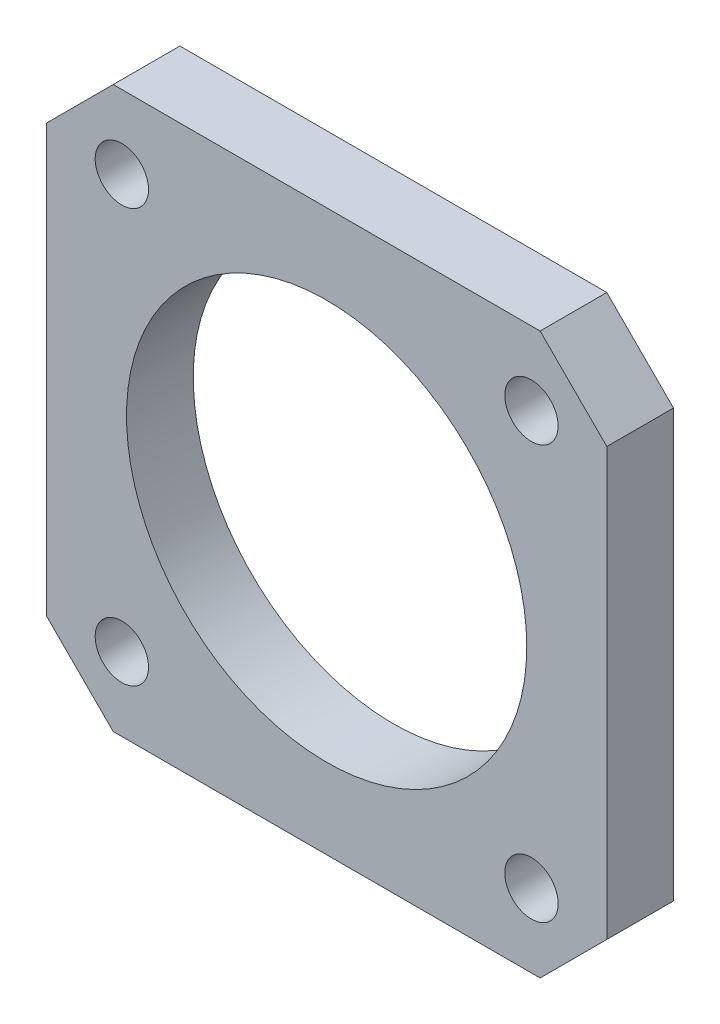
ISO-10303-21;
HEADER;
FILE_DESCRIPTION(('STEP AP214'),'2;1');
FILE_NAME('part.step','',(''),(''),'','','');
FILE_SCHEMA(('AUTOMOTIVE_DESIGN { 1 0 10303 214 1 1 1 1 }'));
ENDSEC;
DATA;
#1=APPLICATION_CONTEXT('core data for automotive mechanical design processes');
#2=APPLICATION_PROTOCOL_DEFINITION('international standard','automotive_design',2000,#1);
#3=PRODUCT_CONTEXT('',#1,'mechanical');
#4=PRODUCT('Part','Part','',(#3));
#5=PRODUCT_RELATED_PRODUCT_CATEGORY('part','',(#4));
#6=PRODUCT_DEFINITION_FORMATION('','',#4);
#7=PRODUCT_DEFINITION_CONTEXT('part definition',#1,'design');
#8=PRODUCT_DEFINITION('design','',#6,#7);
#9=PRODUCT_DEFINITION_SHAPE('','',#8);
#10=(LENGTH_UNIT() NAMED_UNIT(*) SI_UNIT(.MILLI.,.METRE.));
#11=(NAMED_UNIT(*) PLANE_ANGLE_UNIT() SI_UNIT($,.RADIAN.));
#12=(NAMED_UNIT(*) SI_UNIT($,.STERADIAN.) SOLID_ANGLE_UNIT());
#13=UNCERTAINTY_MEASURE_WITH_UNIT(LENGTH_MEASURE(1.E-05),#10,'distance_accuracy_value','');
#14=(GEOMETRIC_REPRESENTATION_CONTEXT(3) GLOBAL_UNCERTAINTY_ASSIGNED_CONTEXT((#13)) GLOBAL_UNIT_ASSIGNED_CONTEXT((#10,
#11,#12)) REPRESENTATION_CONTEXT('',''));
#15=CARTESIAN_POINT('',(0.,0.,0.));
#16=DIRECTION('',(0.,0.,1.));
#17=DIRECTION('',(1.,0.,0.));
#18=AXIS2_PLACEMENT_3D('',#15,#16,#17);
#19=CARTESIAN_POINT('',(0.,0.,5.));
#20=DIRECTION('',(1.,0.,0.));
#21=DIRECTION('',(0.,0.,-1.));
#22=AXIS2_PLACEMENT_3D('',#19,#20,#21);
#23=PLANE('',#22);
#24=DIRECTION('',(0.,-1.,0.));
#25=VECTOR('',#24,1.);
#26=CARTESIAN_POINT('',(0.,0.,0.));
#27=LINE('',#26,#25);
#28=CARTESIAN_POINT('',(0.,37.,0.));
#29=VERTEX_POINT('',#28);
#30=CARTESIAN_POINT('',(0.,5.00000000000002,0.));
#31=VERTEX_POINT('',#30);
#32=EDGE_CURVE('E131',#29,#31,#27,.T.);
#33=ORIENTED_EDGE('',*,*,#32,.T.);
#34=DIRECTION('',(0.,0.,1.));
#35=VECTOR('',#34,1.);
#36=CARTESIAN_POINT('',(0.,5.00000000000002,5.));
#37=LINE('',#36,#35);
#38=CARTESIAN_POINT('',(0.,5.00000000000002,5.));
#39=VERTEX_POINT('',#38);
#40=EDGE_CURVE('E154',#31,#39,#37,.T.);
#41=ORIENTED_EDGE('',*,*,#40,.T.);
#42=DIRECTION('',(0.,-1.,0.));
#43=VECTOR('',#42,1.);
#44=CARTESIAN_POINT('',(0.,0.,5.));
#45=LINE('',#44,#43);
#46=CARTESIAN_POINT('',(0.,37.,5.));
#47=VERTEX_POINT('',#46);
#48=EDGE_CURVE('E129',#47,#39,#45,.T.);
#49=ORIENTED_EDGE('',*,*,#48,.F.);
#50=DIRECTION('',(0.,0.,-1.));
#51=VECTOR('',#50,1.);
#52=CARTESIAN_POINT('',(0.,37.,5.));
#53=LINE('',#52,#51);
#54=EDGE_CURVE('E151',#47,#29,#53,.T.);
#55=ORIENTED_EDGE('',*,*,#54,.T.);
#56=EDGE_LOOP('',(#33,#41,#49,#55));
#57=FACE_BOUND('',#56,.T.);
#58=ADVANCED_FACE('F35',(#57),#23,.F.);
#59=CARTESIAN_POINT('',(0.,0.,5.));
#60=DIRECTION('',(0.,1.,0.));
#61=DIRECTION('',(0.,0.,1.));
#62=AXIS2_PLACEMENT_3D('',#59,#60,#61);
#63=PLANE('',#62);
#64=DIRECTION('',(1.,0.,0.));
#65=VECTOR('',#64,1.);
#66=CARTESIAN_POINT('',(0.,0.,0.));
#67=LINE('',#66,#65);
#68=CARTESIAN_POINT('',(5.,0.,0.));
#69=VERTEX_POINT('',#68);
#70=CARTESIAN_POINT('',(37.,0.,0.));
#71=VERTEX_POINT('',#70);
#72=EDGE_CURVE('E127',#69,#71,#67,.T.);
#73=ORIENTED_EDGE('',*,*,#72,.T.);
#74=DIRECTION('',(0.,0.,1.));
#75=VECTOR('',#74,1.);
#76=CARTESIAN_POINT('',(37.,0.,5.));
#77=LINE('',#76,#75);
#78=CARTESIAN_POINT('',(37.,0.,5.));
#79=VERTEX_POINT('',#78);
#80=EDGE_CURVE('E106',#71,#79,#77,.T.);
#81=ORIENTED_EDGE('',*,*,#80,.T.);
#82=DIRECTION('',(1.,0.,0.));
#83=VECTOR('',#82,1.);
#84=CARTESIAN_POINT('',(0.,0.,5.));
#85=LINE('',#84,#83);
#86=CARTESIAN_POINT('',(5.,0.,5.));
#87=VERTEX_POINT('',#86);
#88=EDGE_CURVE('E170',#87,#79,#85,.T.);
#89=ORIENTED_EDGE('',*,*,#88,.F.);
#90=DIRECTION('',(0.,0.,-1.));
#91=VECTOR('',#90,1.);
#92=CARTESIAN_POINT('',(5.,0.,5.));
#93=LINE('',#92,#91);
#94=EDGE_CURVE('E111',#87,#69,#93,.T.);
#95=ORIENTED_EDGE('',*,*,#94,.T.);
#96=EDGE_LOOP('',(#73,#81,#89,#95));
#97=FACE_BOUND('',#96,.T.);
#98=ADVANCED_FACE('F231',(#97),#63,.F.);
#99=CARTESIAN_POINT('',(42.,0.,5.));
#100=DIRECTION('',(-1.,0.,0.));
#101=DIRECTION('',(0.,0.,1.));
#102=AXIS2_PLACEMENT_3D('',#99,#100,#101);
#103=PLANE('',#102);
#104=DIRECTION('',(0.,1.,0.));
#105=VECTOR('',#104,1.);
#106=CARTESIAN_POINT('',(42.,0.,5.));
#107=LINE('',#106,#105);
#108=CARTESIAN_POINT('',(42.,5.,5.));
#109=VERTEX_POINT('',#108);
#110=CARTESIAN_POINT('',(42.,37.,5.));
#111=VERTEX_POINT('',#110);
#112=EDGE_CURVE('E120',#109,#111,#107,.T.);
#113=ORIENTED_EDGE('',*,*,#112,.F.);
#114=DIRECTION('',(0.,0.,-1.));
#115=VECTOR('',#114,1.);
#116=CARTESIAN_POINT('',(42.,5.,5.));
#117=LINE('',#116,#115);
#118=CARTESIAN_POINT('',(42.,5.,0.));
#119=VERTEX_POINT('',#118);
#120=EDGE_CURVE('E105',#109,#119,#117,.T.);
#121=ORIENTED_EDGE('',*,*,#120,.T.);
#122=DIRECTION('',(0.,1.,0.));
#123=VECTOR('',#122,1.);
#124=CARTESIAN_POINT('',(42.,0.,0.));
#125=LINE('',#124,#123);
#126=CARTESIAN_POINT('',(42.,37.,0.));
#127=VERTEX_POINT('',#126);
#128=EDGE_CURVE('E118',#119,#127,#125,.T.);
#129=ORIENTED_EDGE('',*,*,#128,.T.);
#130=DIRECTION('',(0.,0.,1.));
#131=VECTOR('',#130,1.);
#132=CARTESIAN_POINT('',(42.,37.,5.));
#133=LINE('',#132,#131);
#134=EDGE_CURVE('E122',#127,#111,#133,.T.);
#135=ORIENTED_EDGE('',*,*,#134,.T.);
#136=EDGE_LOOP('',(#113,#121,#129,#135));
#137=FACE_BOUND('',#136,.T.);
#138=ADVANCED_FACE('F117',(#137),#103,.F.);
#139=CARTESIAN_POINT('',(0.,42.,5.));
#140=DIRECTION('',(0.,-1.,0.));
#141=DIRECTION('',(0.,0.,-1.));
#142=AXIS2_PLACEMENT_3D('',#139,#140,#141);
#143=PLANE('',#142);
#144=DIRECTION('',(-1.,0.,0.));
#145=VECTOR('',#144,1.);
#146=CARTESIAN_POINT('',(0.,42.,0.));
#147=LINE('',#146,#145);
#148=CARTESIAN_POINT('',(37.,42.,0.));
#149=VERTEX_POINT('',#148);
#150=CARTESIAN_POINT('',(5.00000000000002,42.,0.));
#151=VERTEX_POINT('',#150);
#152=EDGE_CURVE('E126',#149,#151,#147,.T.);
#153=ORIENTED_EDGE('',*,*,#152,.T.);
#154=DIRECTION('',(0.,0.,1.));
#155=VECTOR('',#154,1.);
#156=CARTESIAN_POINT('',(5.00000000000002,42.,5.));
#157=LINE('',#156,#155);
#158=CARTESIAN_POINT('',(5.00000000000002,42.,5.));
#159=VERTEX_POINT('',#158);
#160=EDGE_CURVE('E11',#151,#159,#157,.T.);
#161=ORIENTED_EDGE('',*,*,#160,.T.);
#162=DIRECTION('',(-1.,0.,0.));
#163=VECTOR('',#162,1.);
#164=CARTESIAN_POINT('',(0.,42.,5.));
#165=LINE('',#164,#163);
#166=CARTESIAN_POINT('',(37.,42.,5.));
#167=VERTEX_POINT('',#166);
#168=EDGE_CURVE('E135',#167,#159,#165,.T.);
#169=ORIENTED_EDGE('',*,*,#168,.F.);
#170=DIRECTION('',(0.,0.,-1.));
#171=VECTOR('',#170,1.);
#172=CARTESIAN_POINT('',(37.,42.,5.));
#173=LINE('',#172,#171);
#174=EDGE_CURVE('E44',#167,#149,#173,.T.);
#175=ORIENTED_EDGE('',*,*,#174,.T.);
#176=EDGE_LOOP('',(#153,#161,#169,#175));
#177=FACE_BOUND('',#176,.T.);
#178=ADVANCED_FACE('F157',(#177),#143,.F.);
#179=CARTESIAN_POINT('',(0.,0.,5.));
#180=DIRECTION('',(0.,0.,-1.));
#181=DIRECTION('',(-1.,0.,0.));
#182=AXIS2_PLACEMENT_3D('',#179,#180,#181);
#183=PLANE('',#182);
#184=CARTESIAN_POINT('',(36.35,36.5,5.));
#185=DIRECTION('',(0.,0.,1.));
#186=DIRECTION('',(-1.,0.,0.));
#187=AXIS2_PLACEMENT_3D('',#184,#185,#186);
#188=CIRCLE('',#187,2.);
#189=CARTESIAN_POINT('',(34.35,36.5,5.));
#190=VERTEX_POINT('',#189);
#191=EDGE_CURVE('E192',#190,#190,#188,.T.);
#192=ORIENTED_EDGE('',*,*,#191,.F.);
#193=EDGE_LOOP('',(#192));
#194=FACE_BOUND('',#193,.T.);
#195=CARTESIAN_POINT('',(36.35,5.50000000000001,5.));
#196=DIRECTION('',(0.,0.,1.));
#197=DIRECTION('',(1.,0.,0.));
#198=AXIS2_PLACEMENT_3D('',#195,#196,#197);
#199=CIRCLE('',#198,2.);
#200=CARTESIAN_POINT('',(38.35,5.50000000000001,5.));
#201=VERTEX_POINT('',#200);
#202=EDGE_CURVE('E198',#201,#201,#199,.T.);
#203=ORIENTED_EDGE('',*,*,#202,.F.);
#204=EDGE_LOOP('',(#203));
#205=FACE_BOUND('',#204,.T.);
#206=CARTESIAN_POINT('',(5.65,5.50000000000001,5.));
#207=DIRECTION('',(0.,0.,1.));
#208=DIRECTION('',(-1.,0.,0.));
#209=AXIS2_PLACEMENT_3D('',#206,#207,#208);
#210=CIRCLE('',#209,2.);
#211=CARTESIAN_POINT('',(3.64999999999999,5.50000000000001,5.));
#212=VERTEX_POINT('',#211);
#213=EDGE_CURVE('E204',#212,#212,#210,.T.);
#214=ORIENTED_EDGE('',*,*,#213,.F.);
#215=EDGE_LOOP('',(#214));
#216=FACE_BOUND('',#215,.T.);
#217=CARTESIAN_POINT('',(5.65,36.5,5.));
#218=DIRECTION('',(0.,0.,1.));
#219=DIRECTION('',(1.,0.,0.));
#220=AXIS2_PLACEMENT_3D('',#217,#218,#219);
#221=CIRCLE('',#220,2.);
#222=CARTESIAN_POINT('',(7.65,36.5,5.));
#223=VERTEX_POINT('',#222);
#224=EDGE_CURVE('E186',#223,#223,#221,.T.);
#225=ORIENTED_EDGE('',*,*,#224,.F.);
#226=EDGE_LOOP('',(#225));
#227=FACE_BOUND('',#226,.T.);
#228=CARTESIAN_POINT('',(21.,21.,5.));
#229=DIRECTION('',(0.,0.,1.));
#230=DIRECTION('',(1.,0.,0.));
#231=AXIS2_PLACEMENT_3D('',#228,#229,#230);
#232=CIRCLE('',#231,15.);
#233=CARTESIAN_POINT('',(36.,21.,5.));
#234=VERTEX_POINT('',#233);
#235=EDGE_CURVE('E175',#234,#234,#232,.T.);
#236=ORIENTED_EDGE('',*,*,#235,.F.);
#237=EDGE_LOOP('',(#236));
#238=FACE_BOUND('',#237,.T.);
#239=ORIENTED_EDGE('',*,*,#88,.T.);
#240=DIRECTION('',(-0.707106781186549,-0.707106781186546,0.));
#241=VECTOR('',#240,1.);
#242=CARTESIAN_POINT('',(42.,5.,5.));
#243=LINE('',#242,#241);
#244=EDGE_CURVE('E149',#79,#109,#243,.F.);
#245=ORIENTED_EDGE('',*,*,#244,.T.);
#246=ORIENTED_EDGE('',*,*,#112,.T.);
#247=DIRECTION('',(0.707106781186546,-0.70710678118655,0.));
#248=VECTOR('',#247,1.);
#249=CARTESIAN_POINT('',(37.,42.,5.));
#250=LINE('',#249,#248);
#251=EDGE_CURVE('E56',#111,#167,#250,.F.);
#252=ORIENTED_EDGE('',*,*,#251,.T.);
#253=ORIENTED_EDGE('',*,*,#168,.T.);
#254=DIRECTION('',(0.70710678118655,0.707106781186546,0.));
#255=VECTOR('',#254,1.);
#256=CARTESIAN_POINT('',(0.,37.,5.));
#257=LINE('',#256,#255);
#258=EDGE_CURVE('E145',#159,#47,#257,.F.);
#259=ORIENTED_EDGE('',*,*,#258,.T.);
#260=ORIENTED_EDGE('',*,*,#48,.T.);
#261=DIRECTION('',(-0.707106781186546,0.707106781186549,0.));
#262=VECTOR('',#261,1.);
#263=CARTESIAN_POINT('',(5.,0.,5.));
#264=LINE('',#263,#262);
#265=EDGE_CURVE('E147',#39,#87,#264,.F.);
#266=ORIENTED_EDGE('',*,*,#265,.T.);
#267=EDGE_LOOP('',(#239,#245,#246,#252,#253,#259,#260,#266));
#268=FACE_BOUND('',#267,.T.);
#269=ADVANCED_FACE('F220',(#194,#205,#216,#227,#238,#268),#183,.F.);
#270=CARTESIAN_POINT('',(0.,0.,0.));
#271=DIRECTION('',(0.,0.,-1.));
#272=DIRECTION('',(-1.,0.,0.));
#273=AXIS2_PLACEMENT_3D('',#270,#271,#272);
#274=PLANE('',#273);
#275=CARTESIAN_POINT('',(36.35,36.5,0.));
#276=DIRECTION('',(0.,0.,1.));
#277=DIRECTION('',(-1.,0.,0.));
#278=AXIS2_PLACEMENT_3D('',#275,#276,#277);
#279=CIRCLE('',#278,2.);
#280=CARTESIAN_POINT('',(34.35,36.5,0.));
#281=VERTEX_POINT('',#280);
#282=EDGE_CURVE('E195',#281,#281,#279,.T.);
#283=ORIENTED_EDGE('',*,*,#282,.T.);
#284=EDGE_LOOP('',(#283));
#285=FACE_BOUND('',#284,.T.);
#286=CARTESIAN_POINT('',(36.35,5.50000000000001,0.));
#287=DIRECTION('',(0.,0.,1.));
#288=DIRECTION('',(1.,0.,0.));
#289=AXIS2_PLACEMENT_3D('',#286,#287,#288);
#290=CIRCLE('',#289,2.);
#291=CARTESIAN_POINT('',(38.35,5.50000000000001,0.));
#292=VERTEX_POINT('',#291);
#293=EDGE_CURVE('E201',#292,#292,#290,.T.);
#294=ORIENTED_EDGE('',*,*,#293,.T.);
#295=EDGE_LOOP('',(#294));
#296=FACE_BOUND('',#295,.T.);
#297=CARTESIAN_POINT('',(5.65,5.50000000000001,0.));
#298=DIRECTION('',(0.,0.,1.));
#299=DIRECTION('',(-1.,0.,0.));
#300=AXIS2_PLACEMENT_3D('',#297,#298,#299);
#301=CIRCLE('',#300,2.);
#302=CARTESIAN_POINT('',(3.64999999999999,5.50000000000001,0.));
#303=VERTEX_POINT('',#302);
#304=EDGE_CURVE('E189',#303,#303,#301,.T.);
#305=ORIENTED_EDGE('',*,*,#304,.T.);
#306=EDGE_LOOP('',(#305));
#307=FACE_BOUND('',#306,.T.);
#308=CARTESIAN_POINT('',(5.65,36.5,0.));
#309=DIRECTION('',(0.,0.,1.));
#310=DIRECTION('',(1.,0.,0.));
#311=AXIS2_PLACEMENT_3D('',#308,#309,#310);
#312=CIRCLE('',#311,2.);
#313=CARTESIAN_POINT('',(7.65,36.5,0.));
#314=VERTEX_POINT('',#313);
#315=EDGE_CURVE('E184',#314,#314,#312,.T.);
#316=ORIENTED_EDGE('',*,*,#315,.T.);
#317=EDGE_LOOP('',(#316));
#318=FACE_BOUND('',#317,.T.);
#319=CARTESIAN_POINT('',(21.,21.,0.));
#320=DIRECTION('',(0.,0.,1.));
#321=DIRECTION('',(1.,0.,0.));
#322=AXIS2_PLACEMENT_3D('',#319,#320,#321);
#323=CIRCLE('',#322,15.);
#324=CARTESIAN_POINT('',(36.,21.,0.));
#325=VERTEX_POINT('',#324);
#326=EDGE_CURVE('E179',#325,#325,#323,.T.);
#327=ORIENTED_EDGE('',*,*,#326,.T.);
#328=EDGE_LOOP('',(#327));
#329=FACE_BOUND('',#328,.T.);
#330=ORIENTED_EDGE('',*,*,#128,.F.);
#331=DIRECTION('',(0.707106781186549,0.707106781186546,0.));
#332=VECTOR('',#331,1.);
#333=CARTESIAN_POINT('',(18.4999999999999,-18.5,0.));
#334=LINE('',#333,#332);
#335=EDGE_CURVE('E101',#119,#71,#334,.F.);
#336=ORIENTED_EDGE('',*,*,#335,.T.);
#337=ORIENTED_EDGE('',*,*,#72,.F.);
#338=DIRECTION('',(0.707106781186546,-0.707106781186549,0.));
#339=VECTOR('',#338,1.);
#340=CARTESIAN_POINT('',(2.50000000000001,2.5,0.));
#341=LINE('',#340,#339);
#342=EDGE_CURVE('E112',#69,#31,#341,.F.);
#343=ORIENTED_EDGE('',*,*,#342,.T.);
#344=ORIENTED_EDGE('',*,*,#32,.F.);
#345=DIRECTION('',(-0.70710678118655,-0.707106781186546,0.));
#346=VECTOR('',#345,1.);
#347=CARTESIAN_POINT('',(-18.5,18.5000000000001,0.));
#348=LINE('',#347,#346);
#349=EDGE_CURVE('E138',#29,#151,#348,.F.);
#350=ORIENTED_EDGE('',*,*,#349,.T.);
#351=ORIENTED_EDGE('',*,*,#152,.F.);
#352=DIRECTION('',(-0.707106781186546,0.70710678118655,0.));
#353=VECTOR('',#352,1.);
#354=CARTESIAN_POINT('',(39.5000000000001,39.4999999999999,0.));
#355=LINE('',#354,#353);
#356=EDGE_CURVE('E121',#149,#127,#355,.F.);
#357=ORIENTED_EDGE('',*,*,#356,.T.);
#358=EDGE_LOOP('',(#330,#336,#337,#343,#344,#350,#351,#357));
#359=FACE_BOUND('',#358,.T.);
#360=ADVANCED_FACE('F124',(#285,#296,#307,#318,#329,#359),#274,.T.);
#361=CARTESIAN_POINT('',(21.,21.,0.));
#362=DIRECTION('',(0.,0.,1.));
#363=DIRECTION('',(1.,0.,0.));
#364=AXIS2_PLACEMENT_3D('',#361,#362,#363);
#365=CYLINDRICAL_SURFACE('',#364,15.);
#366=ORIENTED_EDGE('',*,*,#326,.F.);
#367=EDGE_LOOP('',(#366));
#368=FACE_BOUND('',#367,.T.);
#369=ORIENTED_EDGE('',*,*,#235,.T.);
#370=EDGE_LOOP('',(#369));
#371=FACE_BOUND('',#370,.T.);
#372=ADVANCED_FACE('F265',(#368,#371),#365,.F.);
#373=CARTESIAN_POINT('',(5.65,36.5,0.));
#374=DIRECTION('',(0.,0.,1.));
#375=DIRECTION('',(1.,0.,0.));
#376=AXIS2_PLACEMENT_3D('',#373,#374,#375);
#377=CYLINDRICAL_SURFACE('',#376,2.);
#378=ORIENTED_EDGE('',*,*,#315,.F.);
#379=EDGE_LOOP('',(#378));
#380=FACE_BOUND('',#379,.T.);
#381=ORIENTED_EDGE('',*,*,#224,.T.);
#382=EDGE_LOOP('',(#381));
#383=FACE_BOUND('',#382,.T.);
#384=ADVANCED_FACE('F216',(#380,#383),#377,.F.);
#385=CARTESIAN_POINT('',(5.65,5.50000000000001,0.));
#386=DIRECTION('',(0.,0.,1.));
#387=DIRECTION('',(1.,0.,0.));
#388=AXIS2_PLACEMENT_3D('',#385,#386,#387);
#389=CYLINDRICAL_SURFACE('',#388,2.);
#390=ORIENTED_EDGE('',*,*,#304,.F.);
#391=EDGE_LOOP('',(#390));
#392=FACE_BOUND('',#391,.T.);
#393=ORIENTED_EDGE('',*,*,#213,.T.);
#394=EDGE_LOOP('',(#393));
#395=FACE_BOUND('',#394,.T.);
#396=ADVANCED_FACE('F212',(#392,#395),#389,.F.);
#397=CARTESIAN_POINT('',(36.35,5.50000000000001,0.));
#398=DIRECTION('',(0.,0.,1.));
#399=DIRECTION('',(1.,0.,0.));
#400=AXIS2_PLACEMENT_3D('',#397,#398,#399);
#401=CYLINDRICAL_SURFACE('',#400,2.);
#402=ORIENTED_EDGE('',*,*,#293,.F.);
#403=EDGE_LOOP('',(#402));
#404=FACE_BOUND('',#403,.T.);
#405=ORIENTED_EDGE('',*,*,#202,.T.);
#406=EDGE_LOOP('',(#405));
#407=FACE_BOUND('',#406,.T.);
#408=ADVANCED_FACE('F215',(#404,#407),#401,.F.);
#409=CARTESIAN_POINT('',(36.35,36.5,0.));
#410=DIRECTION('',(0.,0.,1.));
#411=DIRECTION('',(1.,0.,0.));
#412=AXIS2_PLACEMENT_3D('',#409,#410,#411);
#413=CYLINDRICAL_SURFACE('',#412,2.);
#414=ORIENTED_EDGE('',*,*,#282,.F.);
#415=EDGE_LOOP('',(#414));
#416=FACE_BOUND('',#415,.T.);
#417=ORIENTED_EDGE('',*,*,#191,.T.);
#418=EDGE_LOOP('',(#417));
#419=FACE_BOUND('',#418,.T.);
#420=ADVANCED_FACE('F240',(#416,#419),#413,.F.);
#421=CARTESIAN_POINT('',(42.,5.,5.));
#422=DIRECTION('',(-0.707106781186546,0.707106781186549,0.));
#423=DIRECTION('',(0.,0.,-1.));
#424=AXIS2_PLACEMENT_3D('',#421,#422,#423);
#425=PLANE('',#424);
#426=ORIENTED_EDGE('',*,*,#244,.F.);
#427=ORIENTED_EDGE('',*,*,#80,.F.);
#428=ORIENTED_EDGE('',*,*,#335,.F.);
#429=ORIENTED_EDGE('',*,*,#120,.F.);
#430=EDGE_LOOP('',(#426,#427,#428,#429));
#431=FACE_BOUND('',#430,.T.);
#432=ADVANCED_FACE('F104',(#431),#425,.F.);
#433=CARTESIAN_POINT('',(5.,0.,5.));
#434=DIRECTION('',(0.707106781186549,0.707106781186546,0.));
#435=DIRECTION('',(0.,0.,-1.));
#436=AXIS2_PLACEMENT_3D('',#433,#434,#435);
#437=PLANE('',#436);
#438=ORIENTED_EDGE('',*,*,#265,.F.);
#439=ORIENTED_EDGE('',*,*,#40,.F.);
#440=ORIENTED_EDGE('',*,*,#342,.F.);
#441=ORIENTED_EDGE('',*,*,#94,.F.);
#442=EDGE_LOOP('',(#438,#439,#440,#441));
#443=FACE_BOUND('',#442,.T.);
#444=ADVANCED_FACE('F233',(#443),#437,.F.);
#445=CARTESIAN_POINT('',(0.,37.,5.));
#446=DIRECTION('',(0.707106781186546,-0.70710678118655,0.));
#447=DIRECTION('',(0.,0.,-1.));
#448=AXIS2_PLACEMENT_3D('',#445,#446,#447);
#449=PLANE('',#448);
#450=ORIENTED_EDGE('',*,*,#258,.F.);
#451=ORIENTED_EDGE('',*,*,#160,.F.);
#452=ORIENTED_EDGE('',*,*,#349,.F.);
#453=ORIENTED_EDGE('',*,*,#54,.F.);
#454=EDGE_LOOP('',(#450,#451,#452,#453));
#455=FACE_BOUND('',#454,.T.);
#456=ADVANCED_FACE('F164',(#455),#449,.F.);
#457=CARTESIAN_POINT('',(37.,42.,5.));
#458=DIRECTION('',(-0.70710678118655,-0.707106781186546,0.));
#459=DIRECTION('',(0.,0.,-1.));
#460=AXIS2_PLACEMENT_3D('',#457,#458,#459);
#461=PLANE('',#460);
#462=ORIENTED_EDGE('',*,*,#251,.F.);
#463=ORIENTED_EDGE('',*,*,#134,.F.);
#464=ORIENTED_EDGE('',*,*,#356,.F.);
#465=ORIENTED_EDGE('',*,*,#174,.F.);
#466=EDGE_LOOP('',(#462,#463,#464,#465));
#467=FACE_BOUND('',#466,.T.);
#468=ADVANCED_FACE('F38',(#467),#461,.F.);
#469=CLOSED_SHELL('',(#58,#98,#138,#178,#269,#360,#372,#384,#396,#408,#420,#432,#444,#456,#468));
#470=MANIFOLD_SOLID_BREP('B2',#469);
#471=ADVANCED_BREP_SHAPE_REPRESENTATION('',(#18,#470),#14);
#472=SHAPE_DEFINITION_REPRESENTATION(#9,#471);
ENDSEC;
END-ISO-10303-21;
